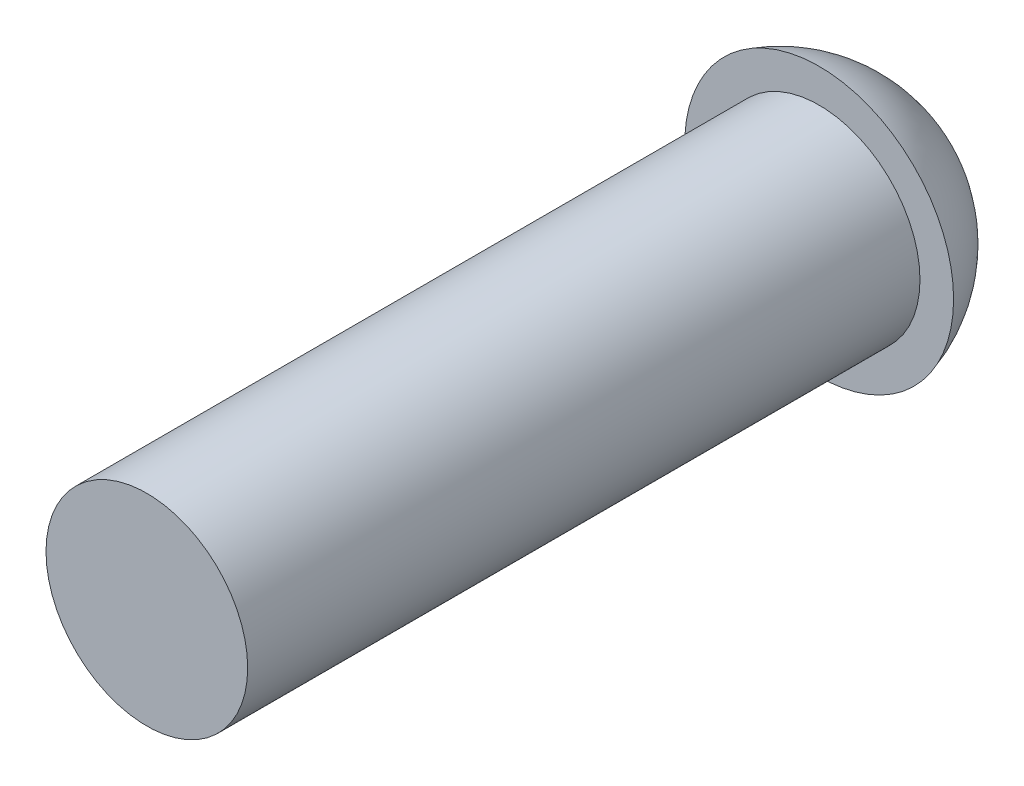
ISO-10303-21;
HEADER;
FILE_DESCRIPTION(('STEP AP214'),'2;1');
FILE_NAME('part.step','',(''),(''),'','','');
FILE_SCHEMA(('AUTOMOTIVE_DESIGN { 1 0 10303 214 1 1 1 1 }'));
ENDSEC;
DATA;
#1=APPLICATION_CONTEXT('core data for automotive mechanical design processes');
#2=APPLICATION_PROTOCOL_DEFINITION('international standard','automotive_design',2000,#1);
#3=PRODUCT_CONTEXT('',#1,'mechanical');
#4=PRODUCT('Part','Part','',(#3));
#5=PRODUCT_RELATED_PRODUCT_CATEGORY('part','',(#4));
#6=PRODUCT_DEFINITION_FORMATION('','',#4);
#7=PRODUCT_DEFINITION_CONTEXT('part definition',#1,'design');
#8=PRODUCT_DEFINITION('design','',#6,#7);
#9=PRODUCT_DEFINITION_SHAPE('','',#8);
#10=(LENGTH_UNIT() NAMED_UNIT(*) SI_UNIT(.MILLI.,.METRE.));
#11=(NAMED_UNIT(*) PLANE_ANGLE_UNIT() SI_UNIT($,.RADIAN.));
#12=(NAMED_UNIT(*) SI_UNIT($,.STERADIAN.) SOLID_ANGLE_UNIT());
#13=UNCERTAINTY_MEASURE_WITH_UNIT(LENGTH_MEASURE(1.E-05),#10,'distance_accuracy_value','');
#14=(GEOMETRIC_REPRESENTATION_CONTEXT(3) GLOBAL_UNCERTAINTY_ASSIGNED_CONTEXT((#13)) GLOBAL_UNIT_ASSIGNED_CONTEXT((#10,
#11,#12)) REPRESENTATION_CONTEXT('',''));
#15=CARTESIAN_POINT('',(0.,0.,0.));
#16=DIRECTION('',(0.,0.,1.));
#17=DIRECTION('',(1.,0.,0.));
#18=AXIS2_PLACEMENT_3D('',#15,#16,#17);
#19=CARTESIAN_POINT('',(0.,0.,-9.41666666666667));
#20=DIRECTION('',(0.,0.,1.));
#21=DIRECTION('',(1.,0.,0.));
#22=AXIS2_PLACEMENT_3D('',#19,#20,#21);
#23=SPHERICAL_SURFACE('',#22,2.08333333333333);
#24=CARTESIAN_POINT('',(0.,0.,-10.));
#25=DIRECTION('',(0.,0.,1.));
#26=DIRECTION('',(1.,0.,0.));
#27=AXIS2_PLACEMENT_3D('',#24,#25,#26);
#28=CIRCLE('',#27,2.);
#29=CARTESIAN_POINT('',(2.,0.,-10.));
#30=VERTEX_POINT('',#29);
#31=EDGE_CURVE('E341',#30,#30,#28,.T.);
#32=ORIENTED_EDGE('',*,*,#31,.F.);
#33=EDGE_LOOP('',(#32));
#34=FACE_BOUND('',#33,.T.);
#35=CARTESIAN_POINT('',(-0.1,0.,-9.41666666666667));
#36=DIRECTION('',(1.,0.,0.));
#37=DIRECTION('',(0.,1.,0.));
#38=AXIS2_PLACEMENT_3D('',#35,#36,#37);
#39=CIRCLE('',#38,2.08093194933851);
#40=CARTESIAN_POINT('',(-0.1,-0.1,-11.495194457623));
#41=VERTEX_POINT('',#40);
#42=CARTESIAN_POINT('',(-0.1,-1.,-11.2415715348112));
#43=VERTEX_POINT('',#42);
#44=EDGE_CURVE('E375',#41,#43,#39,.F.);
#45=ORIENTED_EDGE('',*,*,#44,.T.);
#46=CARTESIAN_POINT('',(0.,-1.,-9.41666666666667));
#47=DIRECTION('',(0.,1.,0.));
#48=DIRECTION('',(0.,0.,1.));
#49=AXIS2_PLACEMENT_3D('',#46,#47,#48);
#50=CIRCLE('',#49,1.82764268328844);
#51=CARTESIAN_POINT('',(0.0999999999999999,-1.,-11.2415715348112));
#52=VERTEX_POINT('',#51);
#53=EDGE_CURVE('E12',#43,#52,#50,.F.);
#54=ORIENTED_EDGE('',*,*,#53,.T.);
#55=CARTESIAN_POINT('',(0.1,0.,-9.41666666666667));
#56=DIRECTION('',(1.,0.,0.));
#57=DIRECTION('',(0.,1.,0.));
#58=AXIS2_PLACEMENT_3D('',#55,#56,#57);
#59=CIRCLE('',#58,2.08093194933851);
#60=CARTESIAN_POINT('',(0.1,-0.1,-11.495194457623));
#61=VERTEX_POINT('',#60);
#62=EDGE_CURVE('E168',#61,#52,#59,.F.);
#63=ORIENTED_EDGE('',*,*,#62,.F.);
#64=CARTESIAN_POINT('',(0.,-0.1,-9.41666666666667));
#65=DIRECTION('',(0.,1.,0.));
#66=DIRECTION('',(-1.,0.,0.));
#67=AXIS2_PLACEMENT_3D('',#64,#65,#66);
#68=CIRCLE('',#67,2.08093194933851);
#69=CARTESIAN_POINT('',(1.,-0.1,-11.2415715348112));
#70=VERTEX_POINT('',#69);
#71=EDGE_CURVE('E386',#61,#70,#68,.F.);
#72=ORIENTED_EDGE('',*,*,#71,.T.);
#73=CARTESIAN_POINT('',(1.,0.,-9.41666666666667));
#74=DIRECTION('',(-1.,0.,0.));
#75=DIRECTION('',(0.,0.,1.));
#76=AXIS2_PLACEMENT_3D('',#73,#74,#75);
#77=CIRCLE('',#76,1.82764268328844);
#78=CARTESIAN_POINT('',(1.,0.0999999999999999,-11.2415715348112));
#79=VERTEX_POINT('',#78);
#80=EDGE_CURVE('E382',#70,#79,#77,.F.);
#81=ORIENTED_EDGE('',*,*,#80,.T.);
#82=CARTESIAN_POINT('',(0.,0.1,-9.41666666666667));
#83=DIRECTION('',(0.,1.,0.));
#84=DIRECTION('',(-1.,0.,0.));
#85=AXIS2_PLACEMENT_3D('',#82,#83,#84);
#86=CIRCLE('',#85,2.08093194933851);
#87=CARTESIAN_POINT('',(0.1,0.1,-11.495194457623));
#88=VERTEX_POINT('',#87);
#89=EDGE_CURVE('E379',#88,#79,#86,.F.);
#90=ORIENTED_EDGE('',*,*,#89,.F.);
#91=CARTESIAN_POINT('',(0.1,0.,-9.41666666666667));
#92=DIRECTION('',(-1.,0.,0.));
#93=DIRECTION('',(0.,0.,1.));
#94=AXIS2_PLACEMENT_3D('',#91,#92,#93);
#95=CIRCLE('',#94,2.08093194933851);
#96=CARTESIAN_POINT('',(0.1,1.,-11.2415715348112));
#97=VERTEX_POINT('',#96);
#98=EDGE_CURVE('E371',#88,#97,#95,.F.);
#99=ORIENTED_EDGE('',*,*,#98,.T.);
#100=CARTESIAN_POINT('',(0.,1.,-9.41666666666667));
#101=DIRECTION('',(0.,-1.,0.));
#102=DIRECTION('',(0.,0.,-1.));
#103=AXIS2_PLACEMENT_3D('',#100,#101,#102);
#104=CIRCLE('',#103,1.82764268328844);
#105=CARTESIAN_POINT('',(-0.1,1.,-11.2415715348112));
#106=VERTEX_POINT('',#105);
#107=EDGE_CURVE('E367',#97,#106,#104,.F.);
#108=ORIENTED_EDGE('',*,*,#107,.T.);
#109=CARTESIAN_POINT('',(-0.1,0.,-9.41666666666667));
#110=DIRECTION('',(-1.,0.,0.));
#111=DIRECTION('',(0.,0.,1.));
#112=AXIS2_PLACEMENT_3D('',#109,#110,#111);
#113=CIRCLE('',#112,2.08093194933851);
#114=CARTESIAN_POINT('',(-0.1,0.1,-11.495194457623));
#115=VERTEX_POINT('',#114);
#116=EDGE_CURVE('E364',#115,#106,#113,.F.);
#117=ORIENTED_EDGE('',*,*,#116,.F.);
#118=CARTESIAN_POINT('',(0.,0.1,-9.41666666666667));
#119=DIRECTION('',(0.,-1.,0.));
#120=DIRECTION('',(0.,0.,-1.));
#121=AXIS2_PLACEMENT_3D('',#118,#119,#120);
#122=CIRCLE('',#121,2.08093194933851);
#123=CARTESIAN_POINT('',(-1.,0.1,-11.2415715348112));
#124=VERTEX_POINT('',#123);
#125=EDGE_CURVE('E360',#115,#124,#122,.F.);
#126=ORIENTED_EDGE('',*,*,#125,.T.);
#127=CARTESIAN_POINT('',(-1.,0.,-9.41666666666667));
#128=DIRECTION('',(1.,0.,0.));
#129=DIRECTION('',(0.,0.,-1.));
#130=AXIS2_PLACEMENT_3D('',#127,#128,#129);
#131=CIRCLE('',#130,1.82764268328844);
#132=CARTESIAN_POINT('',(-1.,-0.1,-11.2415715348112));
#133=VERTEX_POINT('',#132);
#134=EDGE_CURVE('E356',#124,#133,#131,.F.);
#135=ORIENTED_EDGE('',*,*,#134,.T.);
#136=CARTESIAN_POINT('',(0.,-0.1,-9.41666666666667));
#137=DIRECTION('',(0.,-1.,0.));
#138=DIRECTION('',(0.,0.,-1.));
#139=AXIS2_PLACEMENT_3D('',#136,#137,#138);
#140=CIRCLE('',#139,2.08093194933851);
#141=EDGE_CURVE('E353',#41,#133,#140,.F.);
#142=ORIENTED_EDGE('',*,*,#141,.F.);
#143=EDGE_LOOP('',(#45,#54,#63,#72,#81,#90,#99,#108,#117,#126,#135,#142));
#144=FACE_BOUND('',#143,.T.);
#145=ADVANCED_FACE('F159',(#34,#144),#23,.T.);
#146=CARTESIAN_POINT('',(0.,0.,-10.));
#147=DIRECTION('',(0.,0.,1.));
#148=DIRECTION('',(1.,0.,0.));
#149=AXIS2_PLACEMENT_3D('',#146,#147,#148);
#150=CYLINDRICAL_SURFACE('',#149,1.5);
#151=CARTESIAN_POINT('',(0.,0.,-10.));
#152=DIRECTION('',(0.,0.,1.));
#153=DIRECTION('',(1.,0.,0.));
#154=AXIS2_PLACEMENT_3D('',#151,#152,#153);
#155=CIRCLE('',#154,1.5);
#156=CARTESIAN_POINT('',(1.5,0.,-10.));
#157=VERTEX_POINT('',#156);
#158=EDGE_CURVE('E345',#157,#157,#155,.F.);
#159=ORIENTED_EDGE('',*,*,#158,.F.);
#160=EDGE_LOOP('',(#159));
#161=FACE_BOUND('',#160,.T.);
#162=CARTESIAN_POINT('',(0.,0.,0.));
#163=DIRECTION('',(0.,0.,1.));
#164=DIRECTION('',(1.,0.,0.));
#165=AXIS2_PLACEMENT_3D('',#162,#163,#164);
#166=CIRCLE('',#165,1.5);
#167=CARTESIAN_POINT('',(1.5,0.,0.));
#168=VERTEX_POINT('',#167);
#169=EDGE_CURVE('E349',#168,#168,#166,.T.);
#170=ORIENTED_EDGE('',*,*,#169,.F.);
#171=EDGE_LOOP('',(#170));
#172=FACE_BOUND('',#171,.T.);
#173=ADVANCED_FACE('F161',(#161,#172),#150,.T.);
#174=CARTESIAN_POINT('',(0.,0.,0.));
#175=DIRECTION('',(0.,0.,1.));
#176=DIRECTION('',(1.,0.,0.));
#177=AXIS2_PLACEMENT_3D('',#174,#175,#176);
#178=PLANE('',#177);
#179=ORIENTED_EDGE('',*,*,#169,.T.);
#180=EDGE_LOOP('',(#179));
#181=FACE_BOUND('',#180,.T.);
#182=ADVANCED_FACE('F437',(#181),#178,.T.);
#183=CARTESIAN_POINT('',(2.,0.,-10.));
#184=DIRECTION('',(0.,0.,1.));
#185=DIRECTION('',(1.,0.,0.));
#186=AXIS2_PLACEMENT_3D('',#183,#184,#185);
#187=PLANE('',#186);
#188=ORIENTED_EDGE('',*,*,#158,.T.);
#189=EDGE_LOOP('',(#188));
#190=FACE_BOUND('',#189,.T.);
#191=ORIENTED_EDGE('',*,*,#31,.T.);
#192=EDGE_LOOP('',(#191));
#193=FACE_BOUND('',#192,.T.);
#194=ADVANCED_FACE('F429',(#190,#193),#187,.T.);
#195=CARTESIAN_POINT('',(0.,0.,-10.9));
#196=DIRECTION('',(0.,0.,1.));
#197=DIRECTION('',(1.,0.,0.));
#198=AXIS2_PLACEMENT_3D('',#195,#196,#197);
#199=PLANE('',#198);
#200=DIRECTION('',(0.,1.,0.));
#201=VECTOR('',#200,1.);
#202=CARTESIAN_POINT('',(-0.1,0.,-10.9));
#203=LINE('',#202,#201);
#204=CARTESIAN_POINT('',(-0.1,0.1,-10.9));
#205=VERTEX_POINT('',#204);
#206=CARTESIAN_POINT('',(-0.1,1.,-10.9));
#207=VERTEX_POINT('',#206);
#208=EDGE_CURVE('E296',#205,#207,#203,.T.);
#209=ORIENTED_EDGE('',*,*,#208,.T.);
#210=DIRECTION('',(-1.,0.,0.));
#211=VECTOR('',#210,1.);
#212=CARTESIAN_POINT('',(0.1,1.,-10.9));
#213=LINE('',#212,#211);
#214=CARTESIAN_POINT('',(0.1,1.,-10.9));
#215=VERTEX_POINT('',#214);
#216=EDGE_CURVE('E299',#215,#207,#213,.T.);
#217=ORIENTED_EDGE('',*,*,#216,.F.);
#218=DIRECTION('',(0.,1.,0.));
#219=VECTOR('',#218,1.);
#220=CARTESIAN_POINT('',(0.1,0.,-10.9));
#221=LINE('',#220,#219);
#222=CARTESIAN_POINT('',(0.1,0.1,-10.9));
#223=VERTEX_POINT('',#222);
#224=EDGE_CURVE('E304',#223,#215,#221,.T.);
#225=ORIENTED_EDGE('',*,*,#224,.F.);
#226=DIRECTION('',(1.,0.,0.));
#227=VECTOR('',#226,1.);
#228=CARTESIAN_POINT('',(0.,0.1,-10.9));
#229=LINE('',#228,#227);
#230=CARTESIAN_POINT('',(1.,0.0999999999999999,-10.9));
#231=VERTEX_POINT('',#230);
#232=EDGE_CURVE('E278',#223,#231,#229,.T.);
#233=ORIENTED_EDGE('',*,*,#232,.T.);
#234=DIRECTION('',(0.,1.,0.));
#235=VECTOR('',#234,1.);
#236=CARTESIAN_POINT('',(1.,-0.1,-10.9));
#237=LINE('',#236,#235);
#238=CARTESIAN_POINT('',(1.,-0.1,-10.9));
#239=VERTEX_POINT('',#238);
#240=EDGE_CURVE('E281',#239,#231,#237,.T.);
#241=ORIENTED_EDGE('',*,*,#240,.F.);
#242=DIRECTION('',(1.,0.,0.));
#243=VECTOR('',#242,1.);
#244=CARTESIAN_POINT('',(0.,-0.1,-10.9));
#245=LINE('',#244,#243);
#246=CARTESIAN_POINT('',(0.1,-0.1,-10.9));
#247=VERTEX_POINT('',#246);
#248=EDGE_CURVE('E256',#247,#239,#245,.T.);
#249=ORIENTED_EDGE('',*,*,#248,.F.);
#250=DIRECTION('',(0.,-1.,0.));
#251=VECTOR('',#250,1.);
#252=CARTESIAN_POINT('',(0.1,0.,-10.9));
#253=LINE('',#252,#251);
#254=CARTESIAN_POINT('',(0.0999999999999999,-1.,-10.9));
#255=VERTEX_POINT('',#254);
#256=EDGE_CURVE('E250',#247,#255,#253,.T.);
#257=ORIENTED_EDGE('',*,*,#256,.T.);
#258=DIRECTION('',(1.,0.,0.));
#259=VECTOR('',#258,1.);
#260=CARTESIAN_POINT('',(-0.1,-1.,-10.9));
#261=LINE('',#260,#259);
#262=CARTESIAN_POINT('',(-0.1,-1.,-10.9));
#263=VERTEX_POINT('',#262);
#264=EDGE_CURVE('E254',#263,#255,#261,.T.);
#265=ORIENTED_EDGE('',*,*,#264,.F.);
#266=DIRECTION('',(0.,-1.,0.));
#267=VECTOR('',#266,1.);
#268=CARTESIAN_POINT('',(-0.1,0.,-10.9));
#269=LINE('',#268,#267);
#270=CARTESIAN_POINT('',(-0.1,-0.1,-10.9));
#271=VERTEX_POINT('',#270);
#272=EDGE_CURVE('E267',#271,#263,#269,.T.);
#273=ORIENTED_EDGE('',*,*,#272,.F.);
#274=DIRECTION('',(-1.,0.,0.));
#275=VECTOR('',#274,1.);
#276=CARTESIAN_POINT('',(0.,-0.1,-10.9));
#277=LINE('',#276,#275);
#278=CARTESIAN_POINT('',(-1.,-0.1,-10.9));
#279=VERTEX_POINT('',#278);
#280=EDGE_CURVE('E315',#271,#279,#277,.T.);
#281=ORIENTED_EDGE('',*,*,#280,.T.);
#282=DIRECTION('',(0.,-1.,0.));
#283=VECTOR('',#282,1.);
#284=CARTESIAN_POINT('',(-1.,0.1,-10.9));
#285=LINE('',#284,#283);
#286=CARTESIAN_POINT('',(-1.,0.1,-10.9));
#287=VERTEX_POINT('',#286);
#288=EDGE_CURVE('E318',#287,#279,#285,.T.);
#289=ORIENTED_EDGE('',*,*,#288,.F.);
#290=DIRECTION('',(-1.,0.,0.));
#291=VECTOR('',#290,1.);
#292=CARTESIAN_POINT('',(0.,0.1,-10.9));
#293=LINE('',#292,#291);
#294=EDGE_CURVE('E322',#205,#287,#293,.T.);
#295=ORIENTED_EDGE('',*,*,#294,.F.);
#296=EDGE_LOOP('',(#209,#217,#225,#233,#241,#249,#257,#265,#273,#281,#289,#295));
#297=FACE_BOUND('',#296,.T.);
#298=ADVANCED_FACE('F252',(#297),#199,.F.);
#299=CARTESIAN_POINT('',(-0.1,0.,-10.9));
#300=DIRECTION('',(1.,0.,0.));
#301=DIRECTION('',(0.,1.,0.));
#302=AXIS2_PLACEMENT_3D('',#299,#300,#301);
#303=PLANE('',#302);
#304=DIRECTION('',(0.,0.,-1.));
#305=VECTOR('',#304,1.);
#306=CARTESIAN_POINT('',(-0.1,-0.1,-10.9));
#307=LINE('',#306,#305);
#308=EDGE_CURVE('E175',#271,#41,#307,.T.);
#309=ORIENTED_EDGE('',*,*,#308,.F.);
#310=ORIENTED_EDGE('',*,*,#272,.T.);
#311=DIRECTION('',(0.,0.,-1.));
#312=VECTOR('',#311,1.);
#313=CARTESIAN_POINT('',(-0.1,-1.,-10.9));
#314=LINE('',#313,#312);
#315=EDGE_CURVE('E265',#263,#43,#314,.T.);
#316=ORIENTED_EDGE('',*,*,#315,.T.);
#317=ORIENTED_EDGE('',*,*,#44,.F.);
#318=EDGE_LOOP('',(#309,#310,#316,#317));
#319=FACE_BOUND('',#318,.T.);
#320=ADVANCED_FACE('F426',(#319),#303,.T.);
#321=CARTESIAN_POINT('',(-0.1,-1.,-10.9));
#322=DIRECTION('',(0.,1.,0.));
#323=DIRECTION('',(0.,0.,1.));
#324=AXIS2_PLACEMENT_3D('',#321,#322,#323);
#325=PLANE('',#324);
#326=ORIENTED_EDGE('',*,*,#315,.F.);
#327=ORIENTED_EDGE('',*,*,#264,.T.);
#328=DIRECTION('',(0.,0.,-1.));
#329=VECTOR('',#328,1.);
#330=CARTESIAN_POINT('',(0.0999999999999999,-1.,-10.9));
#331=LINE('',#330,#329);
#332=EDGE_CURVE('E264',#255,#52,#331,.T.);
#333=ORIENTED_EDGE('',*,*,#332,.T.);
#334=ORIENTED_EDGE('',*,*,#53,.F.);
#335=EDGE_LOOP('',(#326,#327,#333,#334));
#336=FACE_BOUND('',#335,.T.);
#337=ADVANCED_FACE('F263',(#336),#325,.T.);
#338=CARTESIAN_POINT('',(0.1,0.,-10.9));
#339=DIRECTION('',(1.,0.,0.));
#340=DIRECTION('',(0.,1.,0.));
#341=AXIS2_PLACEMENT_3D('',#338,#339,#340);
#342=PLANE('',#341);
#343=ORIENTED_EDGE('',*,*,#62,.T.);
#344=ORIENTED_EDGE('',*,*,#332,.F.);
#345=ORIENTED_EDGE('',*,*,#256,.F.);
#346=DIRECTION('',(0.,0.,1.));
#347=VECTOR('',#346,1.);
#348=CARTESIAN_POINT('',(0.1,-0.1,-10.9));
#349=LINE('',#348,#347);
#350=EDGE_CURVE('E338',#61,#247,#349,.T.);
#351=ORIENTED_EDGE('',*,*,#350,.F.);
#352=EDGE_LOOP('',(#343,#344,#345,#351));
#353=FACE_BOUND('',#352,.T.);
#354=ADVANCED_FACE('F269',(#353),#342,.F.);
#355=CARTESIAN_POINT('',(0.1,0.,-10.9));
#356=DIRECTION('',(-1.,0.,0.));
#357=DIRECTION('',(0.,0.,1.));
#358=AXIS2_PLACEMENT_3D('',#355,#356,#357);
#359=PLANE('',#358);
#360=DIRECTION('',(0.,0.,1.));
#361=VECTOR('',#360,1.);
#362=CARTESIAN_POINT('',(0.1,0.1,-10.9));
#363=LINE('',#362,#361);
#364=EDGE_CURVE('E261',#88,#223,#363,.T.);
#365=ORIENTED_EDGE('',*,*,#364,.T.);
#366=ORIENTED_EDGE('',*,*,#224,.T.);
#367=DIRECTION('',(0.,0.,-1.));
#368=VECTOR('',#367,1.);
#369=CARTESIAN_POINT('',(0.1,1.,-10.9));
#370=LINE('',#369,#368);
#371=EDGE_CURVE('E308',#215,#97,#370,.T.);
#372=ORIENTED_EDGE('',*,*,#371,.T.);
#373=ORIENTED_EDGE('',*,*,#98,.F.);
#374=EDGE_LOOP('',(#365,#366,#372,#373));
#375=FACE_BOUND('',#374,.T.);
#376=ADVANCED_FACE('F406',(#375),#359,.T.);
#377=CARTESIAN_POINT('',(0.1,1.,-10.9));
#378=DIRECTION('',(0.,-1.,0.));
#379=DIRECTION('',(0.,0.,-1.));
#380=AXIS2_PLACEMENT_3D('',#377,#378,#379);
#381=PLANE('',#380);
#382=ORIENTED_EDGE('',*,*,#371,.F.);
#383=ORIENTED_EDGE('',*,*,#216,.T.);
#384=DIRECTION('',(0.,0.,-1.));
#385=VECTOR('',#384,1.);
#386=CARTESIAN_POINT('',(-0.1,1.,-10.9));
#387=LINE('',#386,#385);
#388=EDGE_CURVE('E307',#207,#106,#387,.T.);
#389=ORIENTED_EDGE('',*,*,#388,.T.);
#390=ORIENTED_EDGE('',*,*,#107,.F.);
#391=EDGE_LOOP('',(#382,#383,#389,#390));
#392=FACE_BOUND('',#391,.T.);
#393=ADVANCED_FACE('F409',(#392),#381,.T.);
#394=CARTESIAN_POINT('',(-0.1,0.,-10.9));
#395=DIRECTION('',(-1.,0.,0.));
#396=DIRECTION('',(0.,0.,1.));
#397=AXIS2_PLACEMENT_3D('',#394,#395,#396);
#398=PLANE('',#397);
#399=ORIENTED_EDGE('',*,*,#116,.T.);
#400=ORIENTED_EDGE('',*,*,#388,.F.);
#401=ORIENTED_EDGE('',*,*,#208,.F.);
#402=DIRECTION('',(0.,0.,1.));
#403=VECTOR('',#402,1.);
#404=CARTESIAN_POINT('',(-0.1,0.1,-10.9));
#405=LINE('',#404,#403);
#406=EDGE_CURVE('E282',#115,#205,#405,.T.);
#407=ORIENTED_EDGE('',*,*,#406,.F.);
#408=EDGE_LOOP('',(#399,#400,#401,#407));
#409=FACE_BOUND('',#408,.T.);
#410=ADVANCED_FACE('F416',(#409),#398,.F.);
#411=CARTESIAN_POINT('',(0.,-0.1,-10.9));
#412=DIRECTION('',(0.,1.,0.));
#413=DIRECTION('',(-1.,0.,0.));
#414=AXIS2_PLACEMENT_3D('',#411,#412,#413);
#415=PLANE('',#414);
#416=ORIENTED_EDGE('',*,*,#350,.T.);
#417=ORIENTED_EDGE('',*,*,#248,.T.);
#418=DIRECTION('',(0.,0.,-1.));
#419=VECTOR('',#418,1.);
#420=CARTESIAN_POINT('',(1.,-0.1,-10.9));
#421=LINE('',#420,#419);
#422=EDGE_CURVE('E289',#239,#70,#421,.T.);
#423=ORIENTED_EDGE('',*,*,#422,.T.);
#424=ORIENTED_EDGE('',*,*,#71,.F.);
#425=EDGE_LOOP('',(#416,#417,#423,#424));
#426=FACE_BOUND('',#425,.T.);
#427=ADVANCED_FACE('F393',(#426),#415,.T.);
#428=CARTESIAN_POINT('',(1.,-0.1,-10.9));
#429=DIRECTION('',(-1.,0.,0.));
#430=DIRECTION('',(0.,0.,1.));
#431=AXIS2_PLACEMENT_3D('',#428,#429,#430);
#432=PLANE('',#431);
#433=ORIENTED_EDGE('',*,*,#422,.F.);
#434=ORIENTED_EDGE('',*,*,#240,.T.);
#435=DIRECTION('',(0.,0.,-1.));
#436=VECTOR('',#435,1.);
#437=CARTESIAN_POINT('',(1.,0.0999999999999999,-10.9));
#438=LINE('',#437,#436);
#439=EDGE_CURVE('E288',#231,#79,#438,.T.);
#440=ORIENTED_EDGE('',*,*,#439,.T.);
#441=ORIENTED_EDGE('',*,*,#80,.F.);
#442=EDGE_LOOP('',(#433,#434,#440,#441));
#443=FACE_BOUND('',#442,.T.);
#444=ADVANCED_FACE('F396',(#443),#432,.T.);
#445=CARTESIAN_POINT('',(0.,0.1,-10.9));
#446=DIRECTION('',(0.,1.,0.));
#447=DIRECTION('',(-1.,0.,0.));
#448=AXIS2_PLACEMENT_3D('',#445,#446,#447);
#449=PLANE('',#448);
#450=ORIENTED_EDGE('',*,*,#89,.T.);
#451=ORIENTED_EDGE('',*,*,#439,.F.);
#452=ORIENTED_EDGE('',*,*,#232,.F.);
#453=ORIENTED_EDGE('',*,*,#364,.F.);
#454=EDGE_LOOP('',(#450,#451,#452,#453));
#455=FACE_BOUND('',#454,.T.);
#456=ADVANCED_FACE('F403',(#455),#449,.F.);
#457=CARTESIAN_POINT('',(0.,0.1,-10.9));
#458=DIRECTION('',(0.,-1.,0.));
#459=DIRECTION('',(0.,0.,-1.));
#460=AXIS2_PLACEMENT_3D('',#457,#458,#459);
#461=PLANE('',#460);
#462=ORIENTED_EDGE('',*,*,#406,.T.);
#463=ORIENTED_EDGE('',*,*,#294,.T.);
#464=DIRECTION('',(0.,0.,-1.));
#465=VECTOR('',#464,1.);
#466=CARTESIAN_POINT('',(-1.,0.1,-10.9));
#467=LINE('',#466,#465);
#468=EDGE_CURVE('E300',#287,#124,#467,.T.);
#469=ORIENTED_EDGE('',*,*,#468,.T.);
#470=ORIENTED_EDGE('',*,*,#125,.F.);
#471=EDGE_LOOP('',(#462,#463,#469,#470));
#472=FACE_BOUND('',#471,.T.);
#473=ADVANCED_FACE('F419',(#472),#461,.T.);
#474=CARTESIAN_POINT('',(-1.,0.1,-10.9));
#475=DIRECTION('',(1.,0.,0.));
#476=DIRECTION('',(0.,0.,-1.));
#477=AXIS2_PLACEMENT_3D('',#474,#475,#476);
#478=PLANE('',#477);
#479=ORIENTED_EDGE('',*,*,#468,.F.);
#480=ORIENTED_EDGE('',*,*,#288,.T.);
#481=DIRECTION('',(0.,0.,-1.));
#482=VECTOR('',#481,1.);
#483=CARTESIAN_POINT('',(-1.,-0.1,-10.9));
#484=LINE('',#483,#482);
#485=EDGE_CURVE('E325',#279,#133,#484,.T.);
#486=ORIENTED_EDGE('',*,*,#485,.T.);
#487=ORIENTED_EDGE('',*,*,#134,.F.);
#488=EDGE_LOOP('',(#479,#480,#486,#487));
#489=FACE_BOUND('',#488,.T.);
#490=ADVANCED_FACE('F422',(#489),#478,.T.);
#491=CARTESIAN_POINT('',(0.,-0.1,-10.9));
#492=DIRECTION('',(0.,-1.,0.));
#493=DIRECTION('',(0.,0.,-1.));
#494=AXIS2_PLACEMENT_3D('',#491,#492,#493);
#495=PLANE('',#494);
#496=ORIENTED_EDGE('',*,*,#141,.T.);
#497=ORIENTED_EDGE('',*,*,#485,.F.);
#498=ORIENTED_EDGE('',*,*,#280,.F.);
#499=ORIENTED_EDGE('',*,*,#308,.T.);
#500=EDGE_LOOP('',(#496,#497,#498,#499));
#501=FACE_BOUND('',#500,.T.);
#502=ADVANCED_FACE('F424',(#501),#495,.F.);
#503=CLOSED_SHELL('',(#145,#173,#182,#194,#298,#320,#337,#354,#376,#393,#410,#427,#444,#456,
#473,#490,#502));
#504=MANIFOLD_SOLID_BREP('B2',#503);
#505=ADVANCED_BREP_SHAPE_REPRESENTATION('',(#18,#504),#14);
#506=SHAPE_DEFINITION_REPRESENTATION(#9,#505);
ENDSEC;
END-ISO-10303-21;
